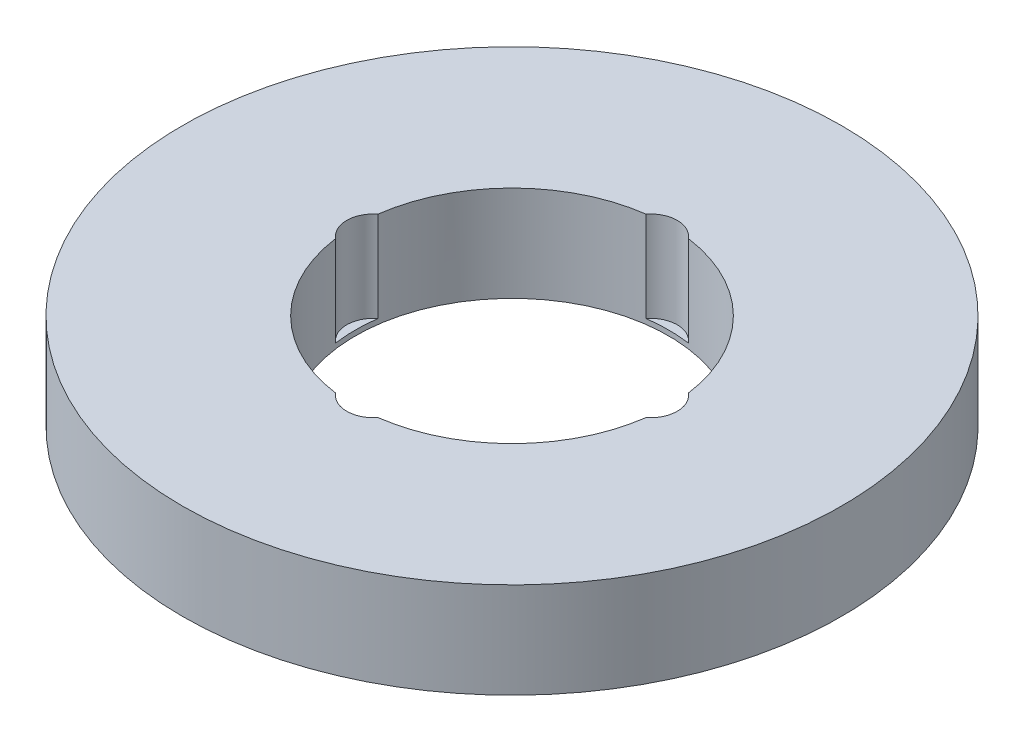
ISO-10303-21;
HEADER;
FILE_DESCRIPTION(('STEP AP214'),'2;1');
FILE_NAME('part.step','',(''),(''),'','','');
FILE_SCHEMA(('AUTOMOTIVE_DESIGN { 1 0 10303 214 1 1 1 1 }'));
ENDSEC;
DATA;
#1=APPLICATION_CONTEXT('core data for automotive mechanical design processes');
#2=APPLICATION_PROTOCOL_DEFINITION('international standard','automotive_design',2000,#1);
#3=PRODUCT_CONTEXT('',#1,'mechanical');
#4=PRODUCT('Part','Part','',(#3));
#5=PRODUCT_RELATED_PRODUCT_CATEGORY('part','',(#4));
#6=PRODUCT_DEFINITION_FORMATION('','',#4);
#7=PRODUCT_DEFINITION_CONTEXT('part definition',#1,'design');
#8=PRODUCT_DEFINITION('design','',#6,#7);
#9=PRODUCT_DEFINITION_SHAPE('','',#8);
#10=(LENGTH_UNIT() NAMED_UNIT(*) SI_UNIT(.MILLI.,.METRE.));
#11=(NAMED_UNIT(*) PLANE_ANGLE_UNIT() SI_UNIT($,.RADIAN.));
#12=(NAMED_UNIT(*) SI_UNIT($,.STERADIAN.) SOLID_ANGLE_UNIT());
#13=UNCERTAINTY_MEASURE_WITH_UNIT(LENGTH_MEASURE(1.E-05),#10,'distance_accuracy_value','');
#14=(GEOMETRIC_REPRESENTATION_CONTEXT(3) GLOBAL_UNCERTAINTY_ASSIGNED_CONTEXT((#13)) GLOBAL_UNIT_ASSIGNED_CONTEXT((#10,
#11,#12)) REPRESENTATION_CONTEXT('',''));
#15=CARTESIAN_POINT('',(0.,0.,0.));
#16=DIRECTION('',(0.,0.,1.));
#17=DIRECTION('',(1.,0.,0.));
#18=AXIS2_PLACEMENT_3D('',#15,#16,#17);
#19=CARTESIAN_POINT('',(0.,29.,0.));
#20=DIRECTION('',(0.,-1.,0.));
#21=DIRECTION('',(0.,0.,-1.));
#22=AXIS2_PLACEMENT_3D('',#19,#20,#21);
#23=CYLINDRICAL_SURFACE('',#22,100.);
#24=CARTESIAN_POINT('',(0.,29.,0.));
#25=DIRECTION('',(0.,1.,0.));
#26=DIRECTION('',(0.,0.,1.));
#27=AXIS2_PLACEMENT_3D('',#24,#25,#26);
#28=CIRCLE('',#27,100.);
#29=CARTESIAN_POINT('',(0.,29.,-100.));
#30=VERTEX_POINT('',#29);
#31=EDGE_CURVE('E148',#30,#30,#28,.T.);
#32=CARTESIAN_POINT('',(0.,0.,0.));
#33=DIRECTION('',(0.,1.,0.));
#34=DIRECTION('',(0.,0.,1.));
#35=AXIS2_PLACEMENT_3D('',#32,#33,#34);
#36=CIRCLE('',#35,100.);
#37=CARTESIAN_POINT('',(0.,0.,-100.));
#38=VERTEX_POINT('',#37);
#39=EDGE_CURVE('E139',#38,#38,#36,.T.);
#40=CARTESIAN_POINT('',(0.,29.,-100.));
#41=CARTESIAN_POINT('',(0.,28.6979166666667,-100.));
#42=CARTESIAN_POINT('',(0.,28.3958333333333,-100.));
#43=CARTESIAN_POINT('',(0.,27.7916666666667,-100.));
#44=CARTESIAN_POINT('',(0.,27.4895833333333,-100.));
#45=CARTESIAN_POINT('',(0.,26.8854166666667,-100.));
#46=CARTESIAN_POINT('',(0.,26.5833333333333,-100.));
#47=CARTESIAN_POINT('',(0.,25.9791666666667,-100.));
#48=CARTESIAN_POINT('',(0.,25.6770833333333,-100.));
#49=CARTESIAN_POINT('',(0.,25.0729166666667,-100.));
#50=CARTESIAN_POINT('',(0.,24.7708333333333,-100.));
#51=CARTESIAN_POINT('',(0.,24.1666666666667,-100.));
#52=CARTESIAN_POINT('',(0.,23.8645833333333,-100.));
#53=CARTESIAN_POINT('',(0.,23.2604166666667,-100.));
#54=CARTESIAN_POINT('',(0.,22.9583333333333,-100.));
#55=CARTESIAN_POINT('',(0.,22.3541666666667,-100.));
#56=CARTESIAN_POINT('',(0.,22.0520833333333,-100.));
#57=CARTESIAN_POINT('',(0.,21.4479166666667,-100.));
#58=CARTESIAN_POINT('',(0.,21.1458333333333,-100.));
#59=CARTESIAN_POINT('',(0.,20.5416666666667,-100.));
#60=CARTESIAN_POINT('',(0.,20.2395833333333,-100.));
#61=CARTESIAN_POINT('',(0.,19.6354166666667,-100.));
#62=CARTESIAN_POINT('',(0.,19.3333333333333,-100.));
#63=CARTESIAN_POINT('',(0.,18.7291666666667,-100.));
#64=CARTESIAN_POINT('',(0.,18.4270833333333,-100.));
#65=CARTESIAN_POINT('',(0.,17.8229166666667,-100.));
#66=CARTESIAN_POINT('',(0.,17.5208333333333,-100.));
#67=CARTESIAN_POINT('',(0.,16.9166666666667,-100.));
#68=CARTESIAN_POINT('',(0.,16.6145833333333,-100.));
#69=CARTESIAN_POINT('',(0.,16.0104166666667,-100.));
#70=CARTESIAN_POINT('',(0.,15.7083333333333,-100.));
#71=CARTESIAN_POINT('',(0.,15.1041666666667,-100.));
#72=CARTESIAN_POINT('',(0.,14.8020833333333,-100.));
#73=CARTESIAN_POINT('',(0.,14.1979166666667,-100.));
#74=CARTESIAN_POINT('',(0.,13.8958333333333,-100.));
#75=CARTESIAN_POINT('',(0.,13.2916666666667,-100.));
#76=CARTESIAN_POINT('',(0.,12.9895833333333,-100.));
#77=CARTESIAN_POINT('',(0.,12.3854166666667,-100.));
#78=CARTESIAN_POINT('',(0.,12.0833333333333,-100.));
#79=CARTESIAN_POINT('',(0.,11.4791666666667,-100.));
#80=CARTESIAN_POINT('',(0.,11.1770833333333,-100.));
#81=CARTESIAN_POINT('',(0.,10.5729166666667,-100.));
#82=CARTESIAN_POINT('',(0.,10.2708333333333,-100.));
#83=CARTESIAN_POINT('',(0.,9.66666666666667,-100.));
#84=CARTESIAN_POINT('',(0.,9.36458333333333,-100.));
#85=CARTESIAN_POINT('',(0.,8.76041666666667,-100.));
#86=CARTESIAN_POINT('',(0.,8.45833333333333,-100.));
#87=CARTESIAN_POINT('',(0.,7.85416666666667,-100.));
#88=CARTESIAN_POINT('',(0.,7.55208333333333,-100.));
#89=CARTESIAN_POINT('',(0.,6.94791666666667,-100.));
#90=CARTESIAN_POINT('',(0.,6.64583333333333,-100.));
#91=CARTESIAN_POINT('',(0.,6.04166666666667,-100.));
#92=CARTESIAN_POINT('',(0.,5.73958333333333,-100.));
#93=CARTESIAN_POINT('',(0.,5.13541666666667,-100.));
#94=CARTESIAN_POINT('',(0.,4.83333333333333,-100.));
#95=CARTESIAN_POINT('',(0.,4.22916666666667,-100.));
#96=CARTESIAN_POINT('',(0.,3.92708333333333,-100.));
#97=CARTESIAN_POINT('',(0.,3.32291666666667,-100.));
#98=CARTESIAN_POINT('',(0.,3.02083333333333,-100.));
#99=CARTESIAN_POINT('',(0.,2.41666666666667,-100.));
#100=CARTESIAN_POINT('',(0.,2.11458333333333,-100.));
#101=CARTESIAN_POINT('',(0.,1.51041666666667,-100.));
#102=CARTESIAN_POINT('',(0.,1.20833333333333,-100.));
#103=CARTESIAN_POINT('',(0.,0.604166666666667,-100.));
#104=CARTESIAN_POINT('',(0.,0.302083333333333,-100.));
#105=CARTESIAN_POINT('',(0.,0.,-100.));
#106=B_SPLINE_CURVE_WITH_KNOTS('',3,(#40,#41,#42,#43,#44,#45,#46,#47,#48,#49,#50,#51,#52,#53,
#54,#55,#56,#57,#58,#59,#60,#61,#62,#63,#64,#65,#66,#67,#68,#69,#70,#71,#72,#73,#74,#75,#76,#77,
#78,#79,#80,#81,#82,#83,#84,#85,#86,#87,#88,#89,#90,#91,#92,#93,#94,#95,#96,#97,#98,#99,#100,
#101,#102,#103,#104,#105),.UNSPECIFIED.,.F.,.F.,(4,2,2,2,2,2,2,2,2,2,2,2,2,2,2,2,2,2,2,2,2,2,2,
2,2,2,2,2,2,2,2,2,4),(0.,0.906249999999997,1.8125,2.71875,3.625,4.53125,5.4375,6.34375,7.25,
8.15625,9.0625,9.96875,10.875,11.78125,12.6875,13.59375,14.5,15.40625,16.3125,17.21875,18.125,
19.03125,19.9375,20.84375,21.75,22.65625,23.5625,24.46875,25.375,26.28125,27.1875,28.09375,29.),.UNSPECIFIED.);
#107=EDGE_CURVE('BSEAM39',#30,#38,#106,.T.);
#108=ORIENTED_EDGE('',*,*,#31,.F.);
#109=ORIENTED_EDGE('',*,*,#39,.T.);
#110=ORIENTED_EDGE('',*,*,#107,.T.);
#111=ORIENTED_EDGE('',*,*,#107,.F.);
#112=EDGE_LOOP('',(#108,#110,#109,#111));
#113=FACE_BOUND('',#112,.T.);
#114=ADVANCED_FACE('F39',(#113),#23,.T.);
#115=CARTESIAN_POINT('',(0.,29.,0.));
#116=DIRECTION('',(0.,1.,0.));
#117=DIRECTION('',(0.,0.,1.));
#118=AXIS2_PLACEMENT_3D('',#115,#116,#117);
#119=PLANE('',#118);
#120=CARTESIAN_POINT('',(1.46495118176866E-13,29.,41.9578694427178));
#121=DIRECTION('',(0.,1.,0.));
#122=DIRECTION('',(1.,0.,0.));
#123=AXIS2_PLACEMENT_3D('',#120,#121,#122);
#124=CIRCLE('',#123,8.20106995030132);
#125=CARTESIAN_POINT('',(-6.4171264256155,29.,47.0645353577157));
#126=VERTEX_POINT('',#125);
#127=CARTESIAN_POINT('',(6.41712642561583,29.,47.0645353577156));
#128=VERTEX_POINT('',#127);
#129=EDGE_CURVE('E175',#126,#128,#124,.T.);
#130=ORIENTED_EDGE('',*,*,#129,.F.);
#131=CARTESIAN_POINT('',(0.,29.,0.));
#132=DIRECTION('',(0.,1.,0.));
#133=DIRECTION('',(0.,0.,1.));
#134=AXIS2_PLACEMENT_3D('',#131,#132,#133);
#135=CIRCLE('',#134,47.5);
#136=CARTESIAN_POINT('',(-47.0645353577156,29.,6.41712642561567));
#137=VERTEX_POINT('',#136);
#138=EDGE_CURVE('E134',#137,#126,#135,.T.);
#139=ORIENTED_EDGE('',*,*,#138,.F.);
#140=CARTESIAN_POINT('',(-41.9578694427178,29.,0.));
#141=DIRECTION('',(0.,1.,0.));
#142=DIRECTION('',(0.,0.,1.));
#143=AXIS2_PLACEMENT_3D('',#140,#141,#142);
#144=CIRCLE('',#143,8.20106995030132);
#145=CARTESIAN_POINT('',(-47.0645353577156,29.,-6.41712642561567));
#146=VERTEX_POINT('',#145);
#147=EDGE_CURVE('E143',#146,#137,#144,.T.);
#148=ORIENTED_EDGE('',*,*,#147,.F.);
#149=CARTESIAN_POINT('',(-6.41712642561616,29.,-47.0645353577156));
#150=VERTEX_POINT('',#149);
#151=EDGE_CURVE('E123',#150,#146,#135,.T.);
#152=ORIENTED_EDGE('',*,*,#151,.F.);
#153=CARTESIAN_POINT('',(-4.39485354530597E-13,29.,-41.9578694427178));
#154=DIRECTION('',(0.,1.,0.));
#155=DIRECTION('',(-1.,0.,0.));
#156=AXIS2_PLACEMENT_3D('',#153,#154,#155);
#157=CIRCLE('',#156,8.20106995030132);
#158=CARTESIAN_POINT('',(6.41712642561517,29.,-47.0645353577157));
#159=VERTEX_POINT('',#158);
#160=EDGE_CURVE('E106',#159,#150,#157,.T.);
#161=ORIENTED_EDGE('',*,*,#160,.F.);
#162=CARTESIAN_POINT('',(47.0645353577156,29.,-6.41712642561567));
#163=VERTEX_POINT('',#162);
#164=EDGE_CURVE('E125',#163,#159,#135,.T.);
#165=ORIENTED_EDGE('',*,*,#164,.F.);
#166=CARTESIAN_POINT('',(41.9578694427178,29.,0.));
#167=DIRECTION('',(0.,1.,0.));
#168=DIRECTION('',(0.,0.,-1.));
#169=AXIS2_PLACEMENT_3D('',#166,#167,#168);
#170=CIRCLE('',#169,8.20106995030132);
#171=CARTESIAN_POINT('',(47.0645353577156,29.,6.41712642561567));
#172=VERTEX_POINT('',#171);
#173=EDGE_CURVE('E286',#172,#163,#170,.T.);
#174=ORIENTED_EDGE('',*,*,#173,.F.);
#175=EDGE_CURVE('E135',#128,#172,#135,.T.);
#176=ORIENTED_EDGE('',*,*,#175,.F.);
#177=EDGE_LOOP('',(#130,#139,#148,#152,#161,#165,#174,#176));
#178=FACE_BOUND('',#177,.T.);
#179=ORIENTED_EDGE('',*,*,#31,.T.);
#180=EDGE_LOOP('',(#179));
#181=FACE_BOUND('',#180,.T.);
#182=ADVANCED_FACE('F118',(#178,#181),#119,.T.);
#183=CARTESIAN_POINT('',(0.,0.,0.));
#184=DIRECTION('',(0.,1.,0.));
#185=DIRECTION('',(0.,0.,1.));
#186=AXIS2_PLACEMENT_3D('',#183,#184,#185);
#187=PLANE('',#186);
#188=CARTESIAN_POINT('',(0.,0.,0.));
#189=DIRECTION('',(0.,1.,0.));
#190=DIRECTION('',(0.,0.,1.));
#191=AXIS2_PLACEMENT_3D('',#188,#189,#190);
#192=CIRCLE('',#191,47.5);
#193=CARTESIAN_POINT('',(0.,0.,47.5));
#194=VERTEX_POINT('',#193);
#195=EDGE_CURVE('E136',#194,#194,#192,.T.);
#196=ORIENTED_EDGE('',*,*,#195,.T.);
#197=EDGE_LOOP('',(#196));
#198=FACE_BOUND('',#197,.T.);
#199=ORIENTED_EDGE('',*,*,#39,.F.);
#200=EDGE_LOOP('',(#199));
#201=FACE_BOUND('',#200,.T.);
#202=ADVANCED_FACE('F187',(#198,#201),#187,.F.);
#203=CARTESIAN_POINT('',(0.,29.,0.));
#204=DIRECTION('',(0.,-1.,0.));
#205=DIRECTION('',(0.,0.,-1.));
#206=AXIS2_PLACEMENT_3D('',#203,#204,#205);
#207=CYLINDRICAL_SURFACE('',#206,47.5);
#208=DIRECTION('',(0.,1.,0.));
#209=VECTOR('',#208,1.);
#210=CARTESIAN_POINT('',(-6.41712642561551,15.2821482824119,47.0645353577157));
#211=LINE('',#210,#209);
#212=CARTESIAN_POINT('',(-6.4171264256155,1.56429656482374,47.0645353577157));
#213=VERTEX_POINT('',#212);
#214=EDGE_CURVE('E11',#213,#126,#211,.T.);
#215=ORIENTED_EDGE('',*,*,#214,.F.);
#216=CARTESIAN_POINT('',(0.,1.56429656482374,0.));
#217=DIRECTION('',(0.,1.,0.));
#218=DIRECTION('',(0.,0.,1.));
#219=AXIS2_PLACEMENT_3D('',#216,#217,#218);
#220=CIRCLE('',#219,47.5);
#221=CARTESIAN_POINT('',(6.41712642561583,1.56429656482374,47.0645353577156));
#222=VERTEX_POINT('',#221);
#223=EDGE_CURVE('E170',#213,#222,#220,.T.);
#224=ORIENTED_EDGE('',*,*,#223,.T.);
#225=DIRECTION('',(0.,1.,0.));
#226=VECTOR('',#225,1.);
#227=CARTESIAN_POINT('',(6.41712642561584,15.2821482824119,47.0645353577156));
#228=LINE('',#227,#226);
#229=EDGE_CURVE('E46',#128,#222,#228,.F.);
#230=ORIENTED_EDGE('',*,*,#229,.F.);
#231=ORIENTED_EDGE('',*,*,#175,.T.);
#232=DIRECTION('',(0.,1.,0.));
#233=VECTOR('',#232,1.);
#234=CARTESIAN_POINT('',(47.0645353577156,15.2821482824119,6.41712642561567));
#235=LINE('',#234,#233);
#236=CARTESIAN_POINT('',(47.0645353577156,1.56429656482374,6.41712642561567));
#237=VERTEX_POINT('',#236);
#238=EDGE_CURVE('E164',#237,#172,#235,.T.);
#239=ORIENTED_EDGE('',*,*,#238,.F.);
#240=CARTESIAN_POINT('',(0.,1.56429656482374,0.));
#241=DIRECTION('',(0.,1.,0.));
#242=DIRECTION('',(0.,0.,1.));
#243=AXIS2_PLACEMENT_3D('',#240,#241,#242);
#244=CIRCLE('',#243,47.5);
#245=CARTESIAN_POINT('',(47.0645353577156,1.56429656482374,-6.41712642561567));
#246=VERTEX_POINT('',#245);
#247=EDGE_CURVE('E115',#237,#246,#244,.T.);
#248=ORIENTED_EDGE('',*,*,#247,.T.);
#249=DIRECTION('',(0.,1.,0.));
#250=VECTOR('',#249,1.);
#251=CARTESIAN_POINT('',(47.0645353577156,15.2821482824119,-6.41712642561567));
#252=LINE('',#251,#250);
#253=EDGE_CURVE('E131',#163,#246,#252,.F.);
#254=ORIENTED_EDGE('',*,*,#253,.F.);
#255=ORIENTED_EDGE('',*,*,#164,.T.);
#256=DIRECTION('',(0.,1.,0.));
#257=VECTOR('',#256,1.);
#258=CARTESIAN_POINT('',(6.41712642561517,15.2821482824119,-47.0645353577157));
#259=LINE('',#258,#257);
#260=CARTESIAN_POINT('',(6.41712642561517,1.56429656482374,-47.0645353577157));
#261=VERTEX_POINT('',#260);
#262=EDGE_CURVE('E105',#261,#159,#259,.T.);
#263=ORIENTED_EDGE('',*,*,#262,.F.);
#264=CARTESIAN_POINT('',(0.,1.56429656482374,0.));
#265=DIRECTION('',(0.,1.,0.));
#266=DIRECTION('',(0.,0.,1.));
#267=AXIS2_PLACEMENT_3D('',#264,#265,#266);
#268=CIRCLE('',#267,47.5);
#269=CARTESIAN_POINT('',(-6.41712642561616,1.56429656482374,-47.0645353577156));
#270=VERTEX_POINT('',#269);
#271=EDGE_CURVE('E159',#261,#270,#268,.T.);
#272=ORIENTED_EDGE('',*,*,#271,.T.);
#273=DIRECTION('',(0.,1.,0.));
#274=VECTOR('',#273,1.);
#275=CARTESIAN_POINT('',(-6.41712642561617,15.2821482824119,-47.0645353577156));
#276=LINE('',#275,#274);
#277=EDGE_CURVE('E114',#150,#270,#276,.F.);
#278=ORIENTED_EDGE('',*,*,#277,.F.);
#279=ORIENTED_EDGE('',*,*,#151,.T.);
#280=DIRECTION('',(0.,1.,0.));
#281=VECTOR('',#280,1.);
#282=CARTESIAN_POINT('',(-47.0645353577156,15.2821482824119,-6.41712642561567));
#283=LINE('',#282,#281);
#284=CARTESIAN_POINT('',(-47.0645353577156,1.56429656482374,-6.41712642561567));
#285=VERTEX_POINT('',#284);
#286=EDGE_CURVE('E160',#285,#146,#283,.T.);
#287=ORIENTED_EDGE('',*,*,#286,.F.);
#288=CARTESIAN_POINT('',(0.,1.56429656482374,0.));
#289=DIRECTION('',(0.,1.,0.));
#290=DIRECTION('',(0.,0.,1.));
#291=AXIS2_PLACEMENT_3D('',#288,#289,#290);
#292=CIRCLE('',#291,47.5);
#293=CARTESIAN_POINT('',(-47.0645353577156,1.56429656482374,6.41712642561567));
#294=VERTEX_POINT('',#293);
#295=EDGE_CURVE('E149',#285,#294,#292,.T.);
#296=ORIENTED_EDGE('',*,*,#295,.T.);
#297=DIRECTION('',(0.,1.,0.));
#298=VECTOR('',#297,1.);
#299=CARTESIAN_POINT('',(-47.0645353577156,15.2821482824119,6.41712642561567));
#300=LINE('',#299,#298);
#301=EDGE_CURVE('E152',#137,#294,#300,.F.);
#302=ORIENTED_EDGE('',*,*,#301,.F.);
#303=ORIENTED_EDGE('',*,*,#138,.T.);
#304=EDGE_LOOP('',(#215,#224,#230,#231,#239,#248,#254,#255,#263,#272,#278,#279,#287,#296,#302,#303));
#305=FACE_BOUND('',#304,.T.);
#306=ORIENTED_EDGE('',*,*,#195,.F.);
#307=EDGE_LOOP('',(#306));
#308=FACE_BOUND('',#307,.T.);
#309=ADVANCED_FACE('F126',(#305,#308),#207,.F.);
#310=CARTESIAN_POINT('',(-41.9578694427178,1.56429656482374,0.));
#311=DIRECTION('',(0.,1.,0.));
#312=DIRECTION('',(0.,0.,1.));
#313=AXIS2_PLACEMENT_3D('',#310,#311,#312);
#314=CYLINDRICAL_SURFACE('',#313,8.20106995030132);
#315=ORIENTED_EDGE('',*,*,#286,.T.);
#316=ORIENTED_EDGE('',*,*,#147,.T.);
#317=ORIENTED_EDGE('',*,*,#301,.T.);
#318=CARTESIAN_POINT('',(-41.9578694427178,1.56429656482374,0.));
#319=DIRECTION('',(0.,1.,0.));
#320=DIRECTION('',(0.,0.,1.));
#321=AXIS2_PLACEMENT_3D('',#318,#319,#320);
#322=CIRCLE('',#321,8.20106995030132);
#323=EDGE_CURVE('E144',#285,#294,#322,.T.);
#324=ORIENTED_EDGE('',*,*,#323,.F.);
#325=EDGE_LOOP('',(#315,#316,#317,#324));
#326=FACE_BOUND('',#325,.T.);
#327=ADVANCED_FACE('F200',(#326),#314,.F.);
#328=CARTESIAN_POINT('',(-41.9578694427178,1.56429656482374,0.));
#329=DIRECTION('',(0.,1.,0.));
#330=DIRECTION('',(0.,0.,1.));
#331=AXIS2_PLACEMENT_3D('',#328,#329,#330);
#332=PLANE('',#331);
#333=ORIENTED_EDGE('',*,*,#323,.T.);
#334=ORIENTED_EDGE('',*,*,#295,.F.);
#335=EDGE_LOOP('',(#333,#334));
#336=FACE_BOUND('',#335,.T.);
#337=ADVANCED_FACE('F201',(#336),#332,.T.);
#338=CARTESIAN_POINT('',(-4.39485354530597E-13,1.56429656482374,-41.9578694427178));
#339=DIRECTION('',(0.,1.,0.));
#340=DIRECTION('',(0.,0.,1.));
#341=AXIS2_PLACEMENT_3D('',#338,#339,#340);
#342=CYLINDRICAL_SURFACE('',#341,8.20106995030132);
#343=ORIENTED_EDGE('',*,*,#262,.T.);
#344=ORIENTED_EDGE('',*,*,#160,.T.);
#345=ORIENTED_EDGE('',*,*,#277,.T.);
#346=CARTESIAN_POINT('',(-4.39485354530597E-13,1.56429656482374,-41.9578694427178));
#347=DIRECTION('',(0.,1.,0.));
#348=DIRECTION('',(-1.,0.,0.));
#349=AXIS2_PLACEMENT_3D('',#346,#347,#348);
#350=CIRCLE('',#349,8.20106995030132);
#351=EDGE_CURVE('E107',#261,#270,#350,.T.);
#352=ORIENTED_EDGE('',*,*,#351,.F.);
#353=EDGE_LOOP('',(#343,#344,#345,#352));
#354=FACE_BOUND('',#353,.T.);
#355=ADVANCED_FACE('F102',(#354),#342,.F.);
#356=CARTESIAN_POINT('',(-4.39485354530597E-13,1.56429656482374,-41.9578694427178));
#357=DIRECTION('',(0.,1.,0.));
#358=DIRECTION('',(-1.,0.,0.));
#359=AXIS2_PLACEMENT_3D('',#356,#357,#358);
#360=PLANE('',#359);
#361=ORIENTED_EDGE('',*,*,#351,.T.);
#362=ORIENTED_EDGE('',*,*,#271,.F.);
#363=EDGE_LOOP('',(#361,#362));
#364=FACE_BOUND('',#363,.T.);
#365=ADVANCED_FACE('F209',(#364),#360,.T.);
#366=CARTESIAN_POINT('',(41.9578694427178,1.56429656482374,0.));
#367=DIRECTION('',(0.,1.,0.));
#368=DIRECTION('',(0.,0.,1.));
#369=AXIS2_PLACEMENT_3D('',#366,#367,#368);
#370=CYLINDRICAL_SURFACE('',#369,8.20106995030132);
#371=ORIENTED_EDGE('',*,*,#238,.T.);
#372=ORIENTED_EDGE('',*,*,#173,.T.);
#373=ORIENTED_EDGE('',*,*,#253,.T.);
#374=CARTESIAN_POINT('',(41.9578694427178,1.56429656482374,0.));
#375=DIRECTION('',(0.,1.,0.));
#376=DIRECTION('',(0.,0.,-1.));
#377=AXIS2_PLACEMENT_3D('',#374,#375,#376);
#378=CIRCLE('',#377,8.20106995030132);
#379=EDGE_CURVE('E56',#237,#246,#378,.T.);
#380=ORIENTED_EDGE('',*,*,#379,.F.);
#381=EDGE_LOOP('',(#371,#372,#373,#380));
#382=FACE_BOUND('',#381,.T.);
#383=ADVANCED_FACE('F213',(#382),#370,.F.);
#384=CARTESIAN_POINT('',(41.9578694427178,1.56429656482374,0.));
#385=DIRECTION('',(0.,1.,0.));
#386=DIRECTION('',(0.,0.,-1.));
#387=AXIS2_PLACEMENT_3D('',#384,#385,#386);
#388=PLANE('',#387);
#389=ORIENTED_EDGE('',*,*,#379,.T.);
#390=ORIENTED_EDGE('',*,*,#247,.F.);
#391=EDGE_LOOP('',(#389,#390));
#392=FACE_BOUND('',#391,.T.);
#393=ADVANCED_FACE('F179',(#392),#388,.T.);
#394=CARTESIAN_POINT('',(1.46495118176866E-13,1.56429656482374,41.9578694427178));
#395=DIRECTION('',(0.,1.,0.));
#396=DIRECTION('',(0.,0.,1.));
#397=AXIS2_PLACEMENT_3D('',#394,#395,#396);
#398=CYLINDRICAL_SURFACE('',#397,8.20106995030132);
#399=ORIENTED_EDGE('',*,*,#214,.T.);
#400=ORIENTED_EDGE('',*,*,#129,.T.);
#401=ORIENTED_EDGE('',*,*,#229,.T.);
#402=CARTESIAN_POINT('',(1.46495118176866E-13,1.56429656482374,41.9578694427178));
#403=DIRECTION('',(0.,1.,0.));
#404=DIRECTION('',(1.,0.,0.));
#405=AXIS2_PLACEMENT_3D('',#402,#403,#404);
#406=CIRCLE('',#405,8.20106995030132);
#407=EDGE_CURVE('E55',#213,#222,#406,.T.);
#408=ORIENTED_EDGE('',*,*,#407,.F.);
#409=EDGE_LOOP('',(#399,#400,#401,#408));
#410=FACE_BOUND('',#409,.T.);
#411=ADVANCED_FACE('F171',(#410),#398,.F.);
#412=CARTESIAN_POINT('',(1.46495118176866E-13,1.56429656482374,41.9578694427178));
#413=DIRECTION('',(0.,1.,0.));
#414=DIRECTION('',(1.,0.,0.));
#415=AXIS2_PLACEMENT_3D('',#412,#413,#414);
#416=PLANE('',#415);
#417=ORIENTED_EDGE('',*,*,#407,.T.);
#418=ORIENTED_EDGE('',*,*,#223,.F.);
#419=EDGE_LOOP('',(#417,#418));
#420=FACE_BOUND('',#419,.T.);
#421=ADVANCED_FACE('F173',(#420),#416,.T.);
#422=CLOSED_SHELL('',(#114,#182,#202,#309,#327,#337,#355,#365,#383,#393,#411,#421));
#423=MANIFOLD_SOLID_BREP('B2',#422);
#424=ADVANCED_BREP_SHAPE_REPRESENTATION('',(#18,#423),#14);
#425=SHAPE_DEFINITION_REPRESENTATION(#9,#424);
ENDSEC;
END-ISO-10303-21;
